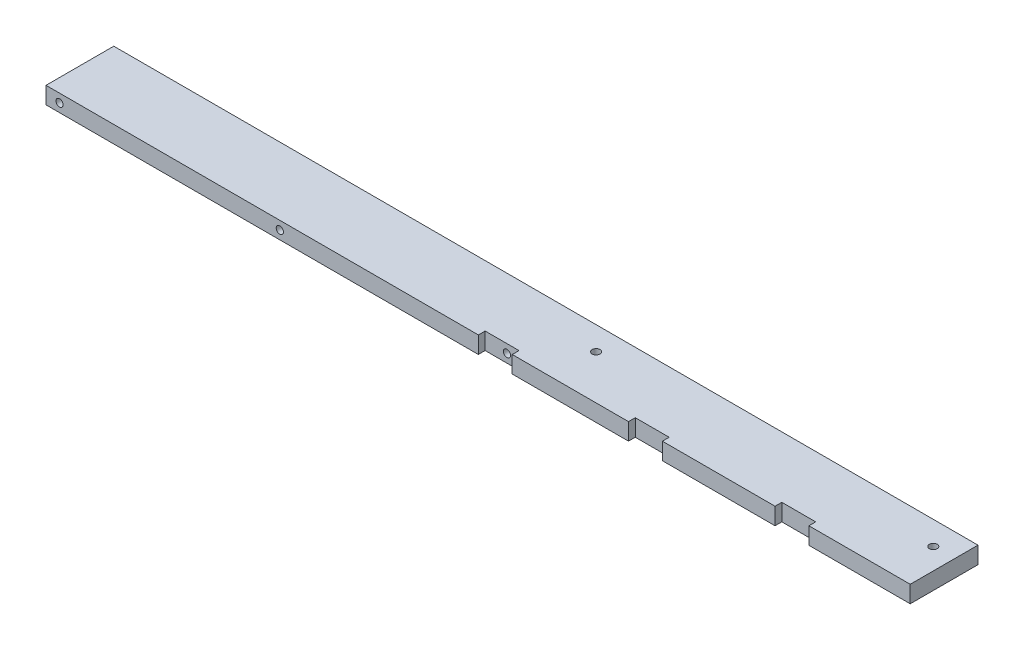
ISO-10303-21;
HEADER;
FILE_DESCRIPTION(('STEP AP214'),'2;1');
FILE_NAME('part.step','',(''),(''),'','','');
FILE_SCHEMA(('AUTOMOTIVE_DESIGN { 1 0 10303 214 1 1 1 1 }'));
ENDSEC;
DATA;
#1=APPLICATION_CONTEXT('core data for automotive mechanical design processes');
#2=APPLICATION_PROTOCOL_DEFINITION('international standard','automotive_design',2000,#1);
#3=PRODUCT_CONTEXT('',#1,'mechanical');
#4=PRODUCT('Part','Part','',(#3));
#5=PRODUCT_RELATED_PRODUCT_CATEGORY('part','',(#4));
#6=PRODUCT_DEFINITION_FORMATION('','',#4);
#7=PRODUCT_DEFINITION_CONTEXT('part definition',#1,'design');
#8=PRODUCT_DEFINITION('design','',#6,#7);
#9=PRODUCT_DEFINITION_SHAPE('','',#8);
#10=(LENGTH_UNIT() NAMED_UNIT(*) SI_UNIT(.MILLI.,.METRE.));
#11=(NAMED_UNIT(*) PLANE_ANGLE_UNIT() SI_UNIT($,.RADIAN.));
#12=(NAMED_UNIT(*) SI_UNIT($,.STERADIAN.) SOLID_ANGLE_UNIT());
#13=UNCERTAINTY_MEASURE_WITH_UNIT(LENGTH_MEASURE(1.E-05),#10,'distance_accuracy_value','');
#14=(GEOMETRIC_REPRESENTATION_CONTEXT(3) GLOBAL_UNCERTAINTY_ASSIGNED_CONTEXT((#13)) GLOBAL_UNIT_ASSIGNED_CONTEXT((#10,
#11,#12)) REPRESENTATION_CONTEXT('',''));
#15=CARTESIAN_POINT('',(0.,0.,0.));
#16=DIRECTION('',(0.,0.,1.));
#17=DIRECTION('',(1.,0.,0.));
#18=AXIS2_PLACEMENT_3D('',#15,#16,#17);
#19=CARTESIAN_POINT('',(323.85,0.,0.));
#20=DIRECTION('',(0.,0.,-1.));
#21=DIRECTION('',(-1.,0.,0.));
#22=AXIS2_PLACEMENT_3D('',#19,#20,#21);
#23=PLANE('',#22);
#24=DIRECTION('',(-1.,0.,0.));
#25=VECTOR('',#24,1.);
#26=CARTESIAN_POINT('',(323.85,6.35,0.));
#27=LINE('',#26,#25);
#28=CARTESIAN_POINT('',(323.85,6.35,0.));
#29=VERTEX_POINT('',#28);
#30=CARTESIAN_POINT('',(285.893126153132,6.35,0.));
#31=VERTEX_POINT('',#30);
#32=EDGE_CURVE('E172',#29,#31,#27,.T.);
#33=ORIENTED_EDGE('',*,*,#32,.T.);
#34=DIRECTION('',(0.,1.,0.));
#35=VECTOR('',#34,1.);
#36=CARTESIAN_POINT('',(285.893126153132,-6.60526299032699,0.));
#37=LINE('',#36,#35);
#38=CARTESIAN_POINT('',(285.893126153132,0.,0.));
#39=VERTEX_POINT('',#38);
#40=EDGE_CURVE('E166',#39,#31,#37,.T.);
#41=ORIENTED_EDGE('',*,*,#40,.F.);
#42=DIRECTION('',(-1.,0.,0.));
#43=VECTOR('',#42,1.);
#44=CARTESIAN_POINT('',(323.85,0.,0.));
#45=LINE('',#44,#43);
#46=CARTESIAN_POINT('',(323.85,0.,0.));
#47=VERTEX_POINT('',#46);
#48=EDGE_CURVE('E188',#47,#39,#45,.T.);
#49=ORIENTED_EDGE('',*,*,#48,.F.);
#50=DIRECTION('',(0.,-1.,0.));
#51=VECTOR('',#50,1.);
#52=CARTESIAN_POINT('',(323.85,0.,0.));
#53=LINE('',#52,#51);
#54=EDGE_CURVE('E218',#29,#47,#53,.T.);
#55=ORIENTED_EDGE('',*,*,#54,.F.);
#56=EDGE_LOOP('',(#33,#41,#49,#55));
#57=FACE_BOUND('',#56,.T.);
#58=ADVANCED_FACE('F36',(#57),#23,.F.);
#59=CARTESIAN_POINT('',(273.193126153132,0.,0.));
#60=VERTEX_POINT('',#59);
#61=CARTESIAN_POINT('',(230.978022183984,0.,0.));
#62=VERTEX_POINT('',#61);
#63=EDGE_CURVE('E165',#60,#62,#45,.T.);
#64=ORIENTED_EDGE('',*,*,#63,.F.);
#65=DIRECTION('',(0.,-1.,0.));
#66=VECTOR('',#65,1.);
#67=CARTESIAN_POINT('',(273.193126153132,-6.60526299032699,0.));
#68=LINE('',#67,#66);
#69=CARTESIAN_POINT('',(273.193126153132,6.35,0.));
#70=VERTEX_POINT('',#69);
#71=EDGE_CURVE('E151',#70,#60,#68,.T.);
#72=ORIENTED_EDGE('',*,*,#71,.F.);
#73=CARTESIAN_POINT('',(230.978022183984,6.35,0.));
#74=VERTEX_POINT('',#73);
#75=EDGE_CURVE('E163',#70,#74,#27,.T.);
#76=ORIENTED_EDGE('',*,*,#75,.T.);
#77=DIRECTION('',(0.,1.,0.));
#78=VECTOR('',#77,1.);
#79=CARTESIAN_POINT('',(230.978022183984,-6.60526299032699,0.));
#80=LINE('',#79,#78);
#81=EDGE_CURVE('E616',#62,#74,#80,.T.);
#82=ORIENTED_EDGE('',*,*,#81,.F.);
#83=EDGE_LOOP('',(#64,#72,#76,#82));
#84=FACE_BOUND('',#83,.T.);
#85=ADVANCED_FACE('F161',(#84),#23,.F.);
#86=CARTESIAN_POINT('',(218.278022183984,0.,0.));
#87=VERTEX_POINT('',#86);
#88=CARTESIAN_POINT('',(174.716366947786,0.,0.));
#89=VERTEX_POINT('',#88);
#90=EDGE_CURVE('E342',#87,#89,#45,.T.);
#91=ORIENTED_EDGE('',*,*,#90,.F.);
#92=DIRECTION('',(0.,-1.,0.));
#93=VECTOR('',#92,1.);
#94=CARTESIAN_POINT('',(218.278022183984,-6.60526299032699,0.));
#95=LINE('',#94,#93);
#96=CARTESIAN_POINT('',(218.278022183984,6.35,0.));
#97=VERTEX_POINT('',#96);
#98=EDGE_CURVE('E612',#97,#87,#95,.T.);
#99=ORIENTED_EDGE('',*,*,#98,.F.);
#100=CARTESIAN_POINT('',(174.716366947786,6.35,0.));
#101=VERTEX_POINT('',#100);
#102=EDGE_CURVE('E173',#97,#101,#27,.T.);
#103=ORIENTED_EDGE('',*,*,#102,.T.);
#104=DIRECTION('',(0.,1.,0.));
#105=VECTOR('',#104,1.);
#106=CARTESIAN_POINT('',(174.716366947786,-7.04680016732617,0.));
#107=LINE('',#106,#105);
#108=EDGE_CURVE('E263',#89,#101,#107,.T.);
#109=ORIENTED_EDGE('',*,*,#108,.F.);
#110=EDGE_LOOP('',(#91,#99,#103,#109));
#111=FACE_BOUND('',#110,.T.);
#112=ADVANCED_FACE('F323',(#111),#23,.F.);
#113=CARTESIAN_POINT('',(170.18,3.175,0.));
#114=DIRECTION('',(0.,0.,1.));
#115=DIRECTION('',(1.,0.,0.));
#116=AXIS2_PLACEMENT_3D('',#113,#114,#115);
#117=CYLINDRICAL_SURFACE('',#116,1.35254999999999);
#118=CARTESIAN_POINT('',(170.18,3.175,-25.4));
#119=DIRECTION('',(0.,0.,1.));
#120=DIRECTION('',(1.,0.,0.));
#121=AXIS2_PLACEMENT_3D('',#118,#119,#120);
#122=CIRCLE('',#121,1.35254999999998);
#123=CARTESIAN_POINT('',(171.53255,3.175,-25.4));
#124=VERTEX_POINT('',#123);
#125=EDGE_CURVE('E227',#124,#124,#122,.T.);
#126=ORIENTED_EDGE('',*,*,#125,.F.);
#127=EDGE_LOOP('',(#126));
#128=FACE_BOUND('',#127,.T.);
#129=CARTESIAN_POINT('',(170.18,3.175,-2.54));
#130=DIRECTION('',(0.,0.,1.));
#131=DIRECTION('',(1.,0.,0.));
#132=AXIS2_PLACEMENT_3D('',#129,#130,#131);
#133=CIRCLE('',#132,1.35254999999999);
#134=CARTESIAN_POINT('',(171.53255,3.175,-2.54));
#135=VERTEX_POINT('',#134);
#136=EDGE_CURVE('E192',#135,#135,#133,.F.);
#137=ORIENTED_EDGE('',*,*,#136,.F.);
#138=EDGE_LOOP('',(#137));
#139=FACE_BOUND('',#138,.T.);
#140=ADVANCED_FACE('F320',(#128,#139),#117,.F.);
#141=CARTESIAN_POINT('',(5.08,3.175,0.));
#142=DIRECTION('',(0.,0.,1.));
#143=DIRECTION('',(1.,0.,0.));
#144=AXIS2_PLACEMENT_3D('',#141,#142,#143);
#145=CIRCLE('',#144,1.35255);
#146=CARTESIAN_POINT('',(6.43255,3.175,0.));
#147=VERTEX_POINT('',#146);
#148=EDGE_CURVE('E304',#147,#147,#145,.T.);
#149=ORIENTED_EDGE('',*,*,#148,.F.);
#150=EDGE_LOOP('',(#149));
#151=FACE_BOUND('',#150,.T.);
#152=CARTESIAN_POINT('',(87.63,3.175,0.));
#153=DIRECTION('',(0.,0.,1.));
#154=DIRECTION('',(1.,0.,0.));
#155=AXIS2_PLACEMENT_3D('',#152,#153,#154);
#156=CIRCLE('',#155,1.35254999999999);
#157=CARTESIAN_POINT('',(88.98255,3.175,0.));
#158=VERTEX_POINT('',#157);
#159=EDGE_CURVE('E310',#158,#158,#156,.T.);
#160=ORIENTED_EDGE('',*,*,#159,.F.);
#161=EDGE_LOOP('',(#160));
#162=FACE_BOUND('',#161,.T.);
#163=CARTESIAN_POINT('',(162.016366947786,0.,0.));
#164=VERTEX_POINT('',#163);
#165=CARTESIAN_POINT('',(0.,0.,0.));
#166=VERTEX_POINT('',#165);
#167=EDGE_CURVE('E187',#164,#166,#45,.T.);
#168=ORIENTED_EDGE('',*,*,#167,.F.);
#169=DIRECTION('',(0.,-1.,0.));
#170=VECTOR('',#169,1.);
#171=CARTESIAN_POINT('',(162.016366947786,-7.04680016732617,0.));
#172=LINE('',#171,#170);
#173=CARTESIAN_POINT('',(162.016366947786,6.35,0.));
#174=VERTEX_POINT('',#173);
#175=EDGE_CURVE('E252',#174,#164,#172,.T.);
#176=ORIENTED_EDGE('',*,*,#175,.F.);
#177=CARTESIAN_POINT('',(0.,6.35,0.));
#178=VERTEX_POINT('',#177);
#179=EDGE_CURVE('E177',#174,#178,#27,.T.);
#180=ORIENTED_EDGE('',*,*,#179,.T.);
#181=DIRECTION('',(0.,-1.,0.));
#182=VECTOR('',#181,1.);
#183=CARTESIAN_POINT('',(0.,0.,0.));
#184=LINE('',#183,#182);
#185=EDGE_CURVE('E233',#178,#166,#184,.T.);
#186=ORIENTED_EDGE('',*,*,#185,.T.);
#187=EDGE_LOOP('',(#168,#176,#180,#186));
#188=FACE_BOUND('',#187,.T.);
#189=ADVANCED_FACE('F38',(#151,#162,#188),#23,.F.);
#190=CARTESIAN_POINT('',(323.85,0.,0.));
#191=DIRECTION('',(0.,1.,0.));
#192=DIRECTION('',(0.,0.,1.));
#193=AXIS2_PLACEMENT_3D('',#190,#191,#192);
#194=PLANE('',#193);
#195=ORIENTED_EDGE('',*,*,#48,.T.);
#196=DIRECTION('',(0.,0.,-1.));
#197=VECTOR('',#196,1.);
#198=CARTESIAN_POINT('',(285.893126153132,0.,0.));
#199=LINE('',#198,#197);
#200=CARTESIAN_POINT('',(285.893126153132,0.,-2.54));
#201=VERTEX_POINT('',#200);
#202=EDGE_CURVE('E602',#39,#201,#199,.T.);
#203=ORIENTED_EDGE('',*,*,#202,.T.);
#204=DIRECTION('',(1.,0.,0.));
#205=VECTOR('',#204,1.);
#206=CARTESIAN_POINT('',(323.85,0.,-2.54));
#207=LINE('',#206,#205);
#208=CARTESIAN_POINT('',(273.193126153132,0.,-2.54));
#209=VERTEX_POINT('',#208);
#210=EDGE_CURVE('E607',#209,#201,#207,.T.);
#211=ORIENTED_EDGE('',*,*,#210,.F.);
#212=DIRECTION('',(0.,0.,1.));
#213=VECTOR('',#212,1.);
#214=CARTESIAN_POINT('',(273.193126153132,0.,0.));
#215=LINE('',#214,#213);
#216=EDGE_CURVE('E609',#209,#60,#215,.T.);
#217=ORIENTED_EDGE('',*,*,#216,.T.);
#218=ORIENTED_EDGE('',*,*,#63,.T.);
#219=DIRECTION('',(0.,0.,-1.));
#220=VECTOR('',#219,1.);
#221=CARTESIAN_POINT('',(230.978022183984,0.,0.));
#222=LINE('',#221,#220);
#223=CARTESIAN_POINT('',(230.978022183984,0.,-2.54));
#224=VERTEX_POINT('',#223);
#225=EDGE_CURVE('E269',#62,#224,#222,.T.);
#226=ORIENTED_EDGE('',*,*,#225,.T.);
#227=DIRECTION('',(1.,0.,0.));
#228=VECTOR('',#227,1.);
#229=CARTESIAN_POINT('',(323.85,0.,-2.54));
#230=LINE('',#229,#228);
#231=CARTESIAN_POINT('',(218.278022183984,0.,-2.54));
#232=VERTEX_POINT('',#231);
#233=EDGE_CURVE('E618',#232,#224,#230,.T.);
#234=ORIENTED_EDGE('',*,*,#233,.F.);
#235=DIRECTION('',(0.,0.,1.));
#236=VECTOR('',#235,1.);
#237=CARTESIAN_POINT('',(218.278022183984,0.,0.));
#238=LINE('',#237,#236);
#239=EDGE_CURVE('E344',#232,#87,#238,.T.);
#240=ORIENTED_EDGE('',*,*,#239,.T.);
#241=ORIENTED_EDGE('',*,*,#90,.T.);
#242=DIRECTION('',(0.,0.,-1.));
#243=VECTOR('',#242,1.);
#244=CARTESIAN_POINT('',(174.716366947786,0.,0.));
#245=LINE('',#244,#243);
#246=CARTESIAN_POINT('',(174.716366947786,0.,-2.54));
#247=VERTEX_POINT('',#246);
#248=EDGE_CURVE('E277',#89,#247,#245,.T.);
#249=ORIENTED_EDGE('',*,*,#248,.T.);
#250=DIRECTION('',(1.,0.,0.));
#251=VECTOR('',#250,1.);
#252=CARTESIAN_POINT('',(323.85,0.,-2.54));
#253=LINE('',#252,#251);
#254=CARTESIAN_POINT('',(162.016366947786,0.,-2.54));
#255=VERTEX_POINT('',#254);
#256=EDGE_CURVE('E274',#255,#247,#253,.T.);
#257=ORIENTED_EDGE('',*,*,#256,.F.);
#258=DIRECTION('',(0.,0.,1.));
#259=VECTOR('',#258,1.);
#260=CARTESIAN_POINT('',(162.016366947786,0.,0.));
#261=LINE('',#260,#259);
#262=EDGE_CURVE('E260',#255,#164,#261,.T.);
#263=ORIENTED_EDGE('',*,*,#262,.T.);
#264=ORIENTED_EDGE('',*,*,#167,.T.);
#265=DIRECTION('',(0.,0.,-1.));
#266=VECTOR('',#265,1.);
#267=CARTESIAN_POINT('',(0.,0.,0.));
#268=LINE('',#267,#266);
#269=CARTESIAN_POINT('',(0.,0.,-25.4));
#270=VERTEX_POINT('',#269);
#271=EDGE_CURVE('E236',#166,#270,#268,.T.);
#272=ORIENTED_EDGE('',*,*,#271,.T.);
#273=DIRECTION('',(-1.,0.,0.));
#274=VECTOR('',#273,1.);
#275=CARTESIAN_POINT('',(323.85,0.,-25.4));
#276=LINE('',#275,#274);
#277=CARTESIAN_POINT('',(323.85,0.,-25.4));
#278=VERTEX_POINT('',#277);
#279=EDGE_CURVE('E184',#278,#270,#276,.T.);
#280=ORIENTED_EDGE('',*,*,#279,.F.);
#281=DIRECTION('',(0.,0.,-1.));
#282=VECTOR('',#281,1.);
#283=CARTESIAN_POINT('',(323.85,0.,0.));
#284=LINE('',#283,#282);
#285=EDGE_CURVE('E220',#47,#278,#284,.T.);
#286=ORIENTED_EDGE('',*,*,#285,.F.);
#287=EDGE_LOOP('',(#195,#203,#211,#217,#218,#226,#234,#240,#241,#249,#257,#263,#264,#272,#280,#286));
#288=FACE_BOUND('',#287,.T.);
#289=CARTESIAN_POINT('',(315.9125,0.,-16.5862));
#290=DIRECTION('',(0.,-1.,0.));
#291=DIRECTION('',(0.,0.,-1.));
#292=AXIS2_PLACEMENT_3D('',#289,#290,#291);
#293=CIRCLE('',#292,2.40030000000002);
#294=CARTESIAN_POINT('',(315.9125,0.,-18.9865));
#295=VERTEX_POINT('',#294);
#296=EDGE_CURVE('E280',#295,#295,#293,.T.);
#297=ORIENTED_EDGE('',*,*,#296,.F.);
#298=EDGE_LOOP('',(#297));
#299=FACE_BOUND('',#298,.T.);
#300=CARTESIAN_POINT('',(189.5475,0.,-16.5862));
#301=DIRECTION('',(0.,-1.,0.));
#302=DIRECTION('',(0.,0.,-1.));
#303=AXIS2_PLACEMENT_3D('',#300,#301,#302);
#304=CIRCLE('',#303,2.40029999999999);
#305=CARTESIAN_POINT('',(189.5475,0.,-18.9865));
#306=VERTEX_POINT('',#305);
#307=EDGE_CURVE('E292',#306,#306,#304,.T.);
#308=ORIENTED_EDGE('',*,*,#307,.F.);
#309=EDGE_LOOP('',(#308));
#310=FACE_BOUND('',#309,.T.);
#311=ADVANCED_FACE('F338',(#288,#299,#310),#194,.F.);
#312=CARTESIAN_POINT('',(323.85,0.,-25.4));
#313=DIRECTION('',(0.,0.,1.));
#314=DIRECTION('',(1.,0.,0.));
#315=AXIS2_PLACEMENT_3D('',#312,#313,#314);
#316=PLANE('',#315);
#317=CARTESIAN_POINT('',(5.08,3.175,-25.4));
#318=DIRECTION('',(0.,0.,1.));
#319=DIRECTION('',(1.,0.,0.));
#320=AXIS2_PLACEMENT_3D('',#317,#318,#319);
#321=CIRCLE('',#320,1.35254999999999);
#322=CARTESIAN_POINT('',(6.43254999999999,3.175,-25.4));
#323=VERTEX_POINT('',#322);
#324=EDGE_CURVE('E307',#323,#323,#321,.T.);
#325=ORIENTED_EDGE('',*,*,#324,.T.);
#326=EDGE_LOOP('',(#325));
#327=FACE_BOUND('',#326,.T.);
#328=CARTESIAN_POINT('',(87.63,3.175,-25.4));
#329=DIRECTION('',(0.,0.,1.));
#330=DIRECTION('',(1.,0.,0.));
#331=AXIS2_PLACEMENT_3D('',#328,#329,#330);
#332=CIRCLE('',#331,1.35254999999999);
#333=CARTESIAN_POINT('',(88.98255,3.175,-25.4));
#334=VERTEX_POINT('',#333);
#335=EDGE_CURVE('E312',#334,#334,#332,.T.);
#336=ORIENTED_EDGE('',*,*,#335,.T.);
#337=EDGE_LOOP('',(#336));
#338=FACE_BOUND('',#337,.T.);
#339=ORIENTED_EDGE('',*,*,#125,.T.);
#340=EDGE_LOOP('',(#339));
#341=FACE_BOUND('',#340,.T.);
#342=DIRECTION('',(0.,1.,0.));
#343=VECTOR('',#342,1.);
#344=CARTESIAN_POINT('',(0.,0.,-25.4));
#345=LINE('',#344,#343);
#346=CARTESIAN_POINT('',(0.,6.35,-25.4));
#347=VERTEX_POINT('',#346);
#348=EDGE_CURVE('E225',#270,#347,#345,.T.);
#349=ORIENTED_EDGE('',*,*,#348,.T.);
#350=DIRECTION('',(-1.,0.,0.));
#351=VECTOR('',#350,1.);
#352=CARTESIAN_POINT('',(323.85,6.35,-25.4));
#353=LINE('',#352,#351);
#354=CARTESIAN_POINT('',(323.85,6.35,-25.4));
#355=VERTEX_POINT('',#354);
#356=EDGE_CURVE('E176',#355,#347,#353,.T.);
#357=ORIENTED_EDGE('',*,*,#356,.F.);
#358=DIRECTION('',(0.,1.,0.));
#359=VECTOR('',#358,1.);
#360=CARTESIAN_POINT('',(323.85,0.,-25.4));
#361=LINE('',#360,#359);
#362=EDGE_CURVE('E222',#278,#355,#361,.T.);
#363=ORIENTED_EDGE('',*,*,#362,.F.);
#364=ORIENTED_EDGE('',*,*,#279,.T.);
#365=EDGE_LOOP('',(#349,#357,#363,#364));
#366=FACE_BOUND('',#365,.T.);
#367=ADVANCED_FACE('F240',(#327,#338,#341,#366),#316,.F.);
#368=CARTESIAN_POINT('',(323.85,6.35,0.));
#369=DIRECTION('',(0.,-1.,0.));
#370=DIRECTION('',(0.,0.,-1.));
#371=AXIS2_PLACEMENT_3D('',#368,#369,#370);
#372=PLANE('',#371);
#373=CARTESIAN_POINT('',(315.9125,6.35,-16.5862));
#374=DIRECTION('',(0.,-1.,0.));
#375=DIRECTION('',(0.,0.,-1.));
#376=AXIS2_PLACEMENT_3D('',#373,#374,#375);
#377=CIRCLE('',#376,1.47320000000001);
#378=CARTESIAN_POINT('',(315.9125,6.35,-18.0594));
#379=VERTEX_POINT('',#378);
#380=EDGE_CURVE('E289',#379,#379,#377,.T.);
#381=ORIENTED_EDGE('',*,*,#380,.T.);
#382=EDGE_LOOP('',(#381));
#383=FACE_BOUND('',#382,.T.);
#384=CARTESIAN_POINT('',(189.5475,6.35,-16.5862));
#385=DIRECTION('',(0.,-1.,0.));
#386=DIRECTION('',(0.,0.,-1.));
#387=AXIS2_PLACEMENT_3D('',#384,#385,#386);
#388=CIRCLE('',#387,1.47320000000001);
#389=CARTESIAN_POINT('',(189.5475,6.35,-18.0594));
#390=VERTEX_POINT('',#389);
#391=EDGE_CURVE('E301',#390,#390,#388,.T.);
#392=ORIENTED_EDGE('',*,*,#391,.T.);
#393=EDGE_LOOP('',(#392));
#394=FACE_BOUND('',#393,.T.);
#395=DIRECTION('',(-1.,0.,0.));
#396=VECTOR('',#395,1.);
#397=CARTESIAN_POINT('',(323.85,6.35,-2.54));
#398=LINE('',#397,#396);
#399=CARTESIAN_POINT('',(285.893126153132,6.35,-2.54));
#400=VERTEX_POINT('',#399);
#401=CARTESIAN_POINT('',(273.193126153132,6.35,-2.54));
#402=VERTEX_POINT('',#401);
#403=EDGE_CURVE('E158',#400,#402,#398,.T.);
#404=ORIENTED_EDGE('',*,*,#403,.F.);
#405=DIRECTION('',(0.,0.,1.));
#406=VECTOR('',#405,1.);
#407=CARTESIAN_POINT('',(285.893126153132,6.35,0.));
#408=LINE('',#407,#406);
#409=EDGE_CURVE('E11',#400,#31,#408,.T.);
#410=ORIENTED_EDGE('',*,*,#409,.T.);
#411=ORIENTED_EDGE('',*,*,#32,.F.);
#412=DIRECTION('',(0.,0.,1.));
#413=VECTOR('',#412,1.);
#414=CARTESIAN_POINT('',(323.85,6.35,0.));
#415=LINE('',#414,#413);
#416=EDGE_CURVE('E231',#355,#29,#415,.T.);
#417=ORIENTED_EDGE('',*,*,#416,.F.);
#418=ORIENTED_EDGE('',*,*,#356,.T.);
#419=DIRECTION('',(0.,0.,1.));
#420=VECTOR('',#419,1.);
#421=CARTESIAN_POINT('',(0.,6.35,0.));
#422=LINE('',#421,#420);
#423=EDGE_CURVE('E180',#347,#178,#422,.T.);
#424=ORIENTED_EDGE('',*,*,#423,.T.);
#425=ORIENTED_EDGE('',*,*,#179,.F.);
#426=DIRECTION('',(0.,0.,-1.));
#427=VECTOR('',#426,1.);
#428=CARTESIAN_POINT('',(162.016366947786,6.35,0.));
#429=LINE('',#428,#427);
#430=CARTESIAN_POINT('',(162.016366947786,6.35,-2.54));
#431=VERTEX_POINT('',#430);
#432=EDGE_CURVE('E191',#174,#431,#429,.T.);
#433=ORIENTED_EDGE('',*,*,#432,.T.);
#434=DIRECTION('',(-1.,0.,0.));
#435=VECTOR('',#434,1.);
#436=CARTESIAN_POINT('',(323.85,6.35,-2.54));
#437=LINE('',#436,#435);
#438=CARTESIAN_POINT('',(174.716366947786,6.35,-2.54));
#439=VERTEX_POINT('',#438);
#440=EDGE_CURVE('E195',#439,#431,#437,.T.);
#441=ORIENTED_EDGE('',*,*,#440,.F.);
#442=DIRECTION('',(0.,0.,1.));
#443=VECTOR('',#442,1.);
#444=CARTESIAN_POINT('',(174.716366947786,6.35,0.));
#445=LINE('',#444,#443);
#446=EDGE_CURVE('E199',#439,#101,#445,.T.);
#447=ORIENTED_EDGE('',*,*,#446,.T.);
#448=ORIENTED_EDGE('',*,*,#102,.F.);
#449=DIRECTION('',(0.,0.,-1.));
#450=VECTOR('',#449,1.);
#451=CARTESIAN_POINT('',(218.278022183984,6.35,0.));
#452=LINE('',#451,#450);
#453=CARTESIAN_POINT('',(218.278022183984,6.35,-2.54));
#454=VERTEX_POINT('',#453);
#455=EDGE_CURVE('E204',#97,#454,#452,.T.);
#456=ORIENTED_EDGE('',*,*,#455,.T.);
#457=DIRECTION('',(-1.,0.,0.));
#458=VECTOR('',#457,1.);
#459=CARTESIAN_POINT('',(323.85,6.35,-2.54));
#460=LINE('',#459,#458);
#461=CARTESIAN_POINT('',(230.978022183984,6.35,-2.54));
#462=VERTEX_POINT('',#461);
#463=EDGE_CURVE('E202',#462,#454,#460,.T.);
#464=ORIENTED_EDGE('',*,*,#463,.F.);
#465=DIRECTION('',(0.,0.,1.));
#466=VECTOR('',#465,1.);
#467=CARTESIAN_POINT('',(230.978022183984,6.35,0.));
#468=LINE('',#467,#466);
#469=EDGE_CURVE('E171',#462,#74,#468,.T.);
#470=ORIENTED_EDGE('',*,*,#469,.T.);
#471=ORIENTED_EDGE('',*,*,#75,.F.);
#472=DIRECTION('',(0.,0.,-1.));
#473=VECTOR('',#472,1.);
#474=CARTESIAN_POINT('',(273.193126153132,6.35,0.));
#475=LINE('',#474,#473);
#476=EDGE_CURVE('E44',#70,#402,#475,.T.);
#477=ORIENTED_EDGE('',*,*,#476,.T.);
#478=EDGE_LOOP('',(#404,#410,#411,#417,#418,#424,#425,#433,#441,#447,#448,#456,#464,#470,#471,#477));
#479=FACE_BOUND('',#478,.T.);
#480=ADVANCED_FACE('F169',(#383,#394,#479),#372,.F.);
#481=CARTESIAN_POINT('',(323.85,0.,0.));
#482=DIRECTION('',(-1.,0.,0.));
#483=DIRECTION('',(0.,0.,1.));
#484=AXIS2_PLACEMENT_3D('',#481,#482,#483);
#485=PLANE('',#484);
#486=ORIENTED_EDGE('',*,*,#54,.T.);
#487=ORIENTED_EDGE('',*,*,#285,.T.);
#488=ORIENTED_EDGE('',*,*,#362,.T.);
#489=ORIENTED_EDGE('',*,*,#416,.T.);
#490=EDGE_LOOP('',(#486,#487,#488,#489));
#491=FACE_BOUND('',#490,.T.);
#492=ADVANCED_FACE('F347',(#491),#485,.F.);
#493=CARTESIAN_POINT('',(0.,0.,0.));
#494=DIRECTION('',(-1.,0.,0.));
#495=DIRECTION('',(0.,0.,1.));
#496=AXIS2_PLACEMENT_3D('',#493,#494,#495);
#497=PLANE('',#496);
#498=ORIENTED_EDGE('',*,*,#185,.F.);
#499=ORIENTED_EDGE('',*,*,#423,.F.);
#500=ORIENTED_EDGE('',*,*,#348,.F.);
#501=ORIENTED_EDGE('',*,*,#271,.F.);
#502=EDGE_LOOP('',(#498,#499,#500,#501));
#503=FACE_BOUND('',#502,.T.);
#504=ADVANCED_FACE('F248',(#503),#497,.T.);
#505=CARTESIAN_POINT('',(87.63,3.175,0.));
#506=DIRECTION('',(0.,0.,1.));
#507=DIRECTION('',(1.,0.,0.));
#508=AXIS2_PLACEMENT_3D('',#505,#506,#507);
#509=CYLINDRICAL_SURFACE('',#508,1.35254999999999);
#510=ORIENTED_EDGE('',*,*,#335,.F.);
#511=EDGE_LOOP('',(#510));
#512=FACE_BOUND('',#511,.T.);
#513=ORIENTED_EDGE('',*,*,#159,.T.);
#514=EDGE_LOOP('',(#513));
#515=FACE_BOUND('',#514,.T.);
#516=ADVANCED_FACE('F354',(#512,#515),#509,.F.);
#517=CARTESIAN_POINT('',(5.08,3.175,0.));
#518=DIRECTION('',(0.,0.,1.));
#519=DIRECTION('',(1.,0.,0.));
#520=AXIS2_PLACEMENT_3D('',#517,#518,#519);
#521=CYLINDRICAL_SURFACE('',#520,1.35254999999999);
#522=ORIENTED_EDGE('',*,*,#324,.F.);
#523=EDGE_LOOP('',(#522));
#524=FACE_BOUND('',#523,.T.);
#525=ORIENTED_EDGE('',*,*,#148,.T.);
#526=EDGE_LOOP('',(#525));
#527=FACE_BOUND('',#526,.T.);
#528=ADVANCED_FACE('F502',(#524,#527),#521,.F.);
#529=CARTESIAN_POINT('',(189.5475,0.,-16.5862));
#530=DIRECTION('',(0.,-1.,0.));
#531=DIRECTION('',(0.,0.,-1.));
#532=AXIS2_PLACEMENT_3D('',#529,#530,#531);
#533=CYLINDRICAL_SURFACE('',#532,1.47320000000001);
#534=ORIENTED_EDGE('',*,*,#391,.F.);
#535=EDGE_LOOP('',(#534));
#536=FACE_BOUND('',#535,.T.);
#537=CARTESIAN_POINT('',(189.5475,2.8448,-16.5862));
#538=DIRECTION('',(0.,-1.,0.));
#539=DIRECTION('',(0.,0.,-1.));
#540=AXIS2_PLACEMENT_3D('',#537,#538,#539);
#541=CIRCLE('',#540,1.47320000000001);
#542=CARTESIAN_POINT('',(189.5475,2.8448,-18.0594));
#543=VERTEX_POINT('',#542);
#544=EDGE_CURVE('E298',#543,#543,#541,.T.);
#545=ORIENTED_EDGE('',*,*,#544,.T.);
#546=EDGE_LOOP('',(#545));
#547=FACE_BOUND('',#546,.T.);
#548=ADVANCED_FACE('F498',(#536,#547),#533,.F.);
#549=CARTESIAN_POINT('',(191.0207,2.8448,-16.5862));
#550=DIRECTION('',(0.,1.,0.));
#551=DIRECTION('',(0.,0.,1.));
#552=AXIS2_PLACEMENT_3D('',#549,#550,#551);
#553=PLANE('',#552);
#554=ORIENTED_EDGE('',*,*,#544,.F.);
#555=EDGE_LOOP('',(#554));
#556=FACE_BOUND('',#555,.T.);
#557=CARTESIAN_POINT('',(189.5475,2.8448,-16.5862));
#558=DIRECTION('',(0.,-1.,0.));
#559=DIRECTION('',(0.,0.,-1.));
#560=AXIS2_PLACEMENT_3D('',#557,#558,#559);
#561=CIRCLE('',#560,2.40029999999999);
#562=CARTESIAN_POINT('',(189.5475,2.8448,-18.9865));
#563=VERTEX_POINT('',#562);
#564=EDGE_CURVE('E295',#563,#563,#561,.T.);
#565=ORIENTED_EDGE('',*,*,#564,.T.);
#566=EDGE_LOOP('',(#565));
#567=FACE_BOUND('',#566,.T.);
#568=ADVANCED_FACE('F494',(#556,#567),#553,.F.);
#569=CARTESIAN_POINT('',(189.5475,0.,-16.5862));
#570=DIRECTION('',(0.,-1.,0.));
#571=DIRECTION('',(0.,0.,-1.));
#572=AXIS2_PLACEMENT_3D('',#569,#570,#571);
#573=CYLINDRICAL_SURFACE('',#572,2.40029999999999);
#574=ORIENTED_EDGE('',*,*,#564,.F.);
#575=EDGE_LOOP('',(#574));
#576=FACE_BOUND('',#575,.T.);
#577=ORIENTED_EDGE('',*,*,#307,.T.);
#578=EDGE_LOOP('',(#577));
#579=FACE_BOUND('',#578,.T.);
#580=ADVANCED_FACE('F490',(#576,#579),#573,.F.);
#581=CARTESIAN_POINT('',(315.9125,0.,-16.5862));
#582=DIRECTION('',(0.,-1.,0.));
#583=DIRECTION('',(0.,0.,-1.));
#584=AXIS2_PLACEMENT_3D('',#581,#582,#583);
#585=CYLINDRICAL_SURFACE('',#584,1.47320000000001);
#586=ORIENTED_EDGE('',*,*,#380,.F.);
#587=EDGE_LOOP('',(#586));
#588=FACE_BOUND('',#587,.T.);
#589=CARTESIAN_POINT('',(315.9125,2.8448,-16.5862));
#590=DIRECTION('',(0.,-1.,0.));
#591=DIRECTION('',(0.,0.,-1.));
#592=AXIS2_PLACEMENT_3D('',#589,#590,#591);
#593=CIRCLE('',#592,1.47320000000001);
#594=CARTESIAN_POINT('',(315.9125,2.8448,-18.0594));
#595=VERTEX_POINT('',#594);
#596=EDGE_CURVE('E286',#595,#595,#593,.T.);
#597=ORIENTED_EDGE('',*,*,#596,.T.);
#598=EDGE_LOOP('',(#597));
#599=FACE_BOUND('',#598,.T.);
#600=ADVANCED_FACE('F486',(#588,#599),#585,.F.);
#601=CARTESIAN_POINT('',(317.3857,2.8448,-16.5862));
#602=DIRECTION('',(0.,1.,0.));
#603=DIRECTION('',(0.,0.,1.));
#604=AXIS2_PLACEMENT_3D('',#601,#602,#603);
#605=PLANE('',#604);
#606=ORIENTED_EDGE('',*,*,#596,.F.);
#607=EDGE_LOOP('',(#606));
#608=FACE_BOUND('',#607,.T.);
#609=CARTESIAN_POINT('',(315.9125,2.8448,-16.5862));
#610=DIRECTION('',(0.,-1.,0.));
#611=DIRECTION('',(0.,0.,-1.));
#612=AXIS2_PLACEMENT_3D('',#609,#610,#611);
#613=CIRCLE('',#612,2.40030000000002);
#614=CARTESIAN_POINT('',(315.9125,2.8448,-18.9865));
#615=VERTEX_POINT('',#614);
#616=EDGE_CURVE('E283',#615,#615,#613,.T.);
#617=ORIENTED_EDGE('',*,*,#616,.T.);
#618=EDGE_LOOP('',(#617));
#619=FACE_BOUND('',#618,.T.);
#620=ADVANCED_FACE('F482',(#608,#619),#605,.F.);
#621=CARTESIAN_POINT('',(315.9125,0.,-16.5862));
#622=DIRECTION('',(0.,-1.,0.));
#623=DIRECTION('',(0.,0.,-1.));
#624=AXIS2_PLACEMENT_3D('',#621,#622,#623);
#625=CYLINDRICAL_SURFACE('',#624,2.40030000000002);
#626=ORIENTED_EDGE('',*,*,#616,.F.);
#627=EDGE_LOOP('',(#626));
#628=FACE_BOUND('',#627,.T.);
#629=ORIENTED_EDGE('',*,*,#296,.T.);
#630=EDGE_LOOP('',(#629));
#631=FACE_BOUND('',#630,.T.);
#632=ADVANCED_FACE('F407',(#628,#631),#625,.F.);
#633=CARTESIAN_POINT('',(174.716366947786,-7.04680016732617,-2.54));
#634=DIRECTION('',(1.,0.,0.));
#635=DIRECTION('',(0.,0.,-1.));
#636=AXIS2_PLACEMENT_3D('',#633,#634,#635);
#637=PLANE('',#636);
#638=ORIENTED_EDGE('',*,*,#108,.T.);
#639=ORIENTED_EDGE('',*,*,#446,.F.);
#640=DIRECTION('',(0.,1.,0.));
#641=VECTOR('',#640,1.);
#642=CARTESIAN_POINT('',(174.716366947786,-7.04680016732617,-2.54));
#643=LINE('',#642,#641);
#644=EDGE_CURVE('E196',#247,#439,#643,.T.);
#645=ORIENTED_EDGE('',*,*,#644,.F.);
#646=ORIENTED_EDGE('',*,*,#248,.F.);
#647=EDGE_LOOP('',(#638,#639,#645,#646));
#648=FACE_BOUND('',#647,.T.);
#649=ADVANCED_FACE('F336',(#648),#637,.F.);
#650=CARTESIAN_POINT('',(162.016366947786,-7.04680016732617,-2.54));
#651=DIRECTION('',(-1.,0.,0.));
#652=DIRECTION('',(0.,0.,1.));
#653=AXIS2_PLACEMENT_3D('',#650,#651,#652);
#654=PLANE('',#653);
#655=DIRECTION('',(0.,-1.,0.));
#656=VECTOR('',#655,1.);
#657=CARTESIAN_POINT('',(162.016366947786,-7.04680016732617,-2.54));
#658=LINE('',#657,#656);
#659=EDGE_CURVE('E259',#431,#255,#658,.T.);
#660=ORIENTED_EDGE('',*,*,#659,.F.);
#661=ORIENTED_EDGE('',*,*,#432,.F.);
#662=ORIENTED_EDGE('',*,*,#175,.T.);
#663=ORIENTED_EDGE('',*,*,#262,.F.);
#664=EDGE_LOOP('',(#660,#661,#662,#663));
#665=FACE_BOUND('',#664,.T.);
#666=ADVANCED_FACE('F256',(#665),#654,.F.);
#667=CARTESIAN_POINT('',(0.,0.,-2.54));
#668=DIRECTION('',(0.,0.,1.));
#669=DIRECTION('',(1.,0.,0.));
#670=AXIS2_PLACEMENT_3D('',#667,#668,#669);
#671=PLANE('',#670);
#672=ORIENTED_EDGE('',*,*,#136,.T.);
#673=EDGE_LOOP('',(#672));
#674=FACE_BOUND('',#673,.T.);
#675=ORIENTED_EDGE('',*,*,#256,.T.);
#676=ORIENTED_EDGE('',*,*,#644,.T.);
#677=ORIENTED_EDGE('',*,*,#440,.T.);
#678=ORIENTED_EDGE('',*,*,#659,.T.);
#679=EDGE_LOOP('',(#675,#676,#677,#678));
#680=FACE_BOUND('',#679,.T.);
#681=ADVANCED_FACE('F327',(#674,#680),#671,.T.);
#682=CARTESIAN_POINT('',(230.978022183984,-6.60526299032699,-2.54));
#683=DIRECTION('',(1.,0.,0.));
#684=DIRECTION('',(0.,0.,-1.));
#685=AXIS2_PLACEMENT_3D('',#682,#683,#684);
#686=PLANE('',#685);
#687=ORIENTED_EDGE('',*,*,#81,.T.);
#688=ORIENTED_EDGE('',*,*,#469,.F.);
#689=DIRECTION('',(0.,1.,0.));
#690=VECTOR('',#689,1.);
#691=CARTESIAN_POINT('',(230.978022183984,-6.60526299032699,-2.54));
#692=LINE('',#691,#690);
#693=EDGE_CURVE('E59',#224,#462,#692,.T.);
#694=ORIENTED_EDGE('',*,*,#693,.F.);
#695=ORIENTED_EDGE('',*,*,#225,.F.);
#696=EDGE_LOOP('',(#687,#688,#694,#695));
#697=FACE_BOUND('',#696,.T.);
#698=ADVANCED_FACE('F329',(#697),#686,.F.);
#699=CARTESIAN_POINT('',(218.278022183984,-6.60526299032699,-2.54));
#700=DIRECTION('',(-1.,0.,0.));
#701=DIRECTION('',(0.,0.,1.));
#702=AXIS2_PLACEMENT_3D('',#699,#700,#701);
#703=PLANE('',#702);
#704=DIRECTION('',(0.,-1.,0.));
#705=VECTOR('',#704,1.);
#706=CARTESIAN_POINT('',(218.278022183984,-6.60526299032699,-2.54));
#707=LINE('',#706,#705);
#708=EDGE_CURVE('E613',#454,#232,#707,.T.);
#709=ORIENTED_EDGE('',*,*,#708,.F.);
#710=ORIENTED_EDGE('',*,*,#455,.F.);
#711=ORIENTED_EDGE('',*,*,#98,.T.);
#712=ORIENTED_EDGE('',*,*,#239,.F.);
#713=EDGE_LOOP('',(#709,#710,#711,#712));
#714=FACE_BOUND('',#713,.T.);
#715=ADVANCED_FACE('F432',(#714),#703,.F.);
#716=CARTESIAN_POINT('',(0.,0.,-2.54));
#717=DIRECTION('',(0.,0.,1.));
#718=DIRECTION('',(1.,0.,0.));
#719=AXIS2_PLACEMENT_3D('',#716,#717,#718);
#720=PLANE('',#719);
#721=ORIENTED_EDGE('',*,*,#233,.T.);
#722=ORIENTED_EDGE('',*,*,#693,.T.);
#723=ORIENTED_EDGE('',*,*,#463,.T.);
#724=ORIENTED_EDGE('',*,*,#708,.T.);
#725=EDGE_LOOP('',(#721,#722,#723,#724));
#726=FACE_BOUND('',#725,.T.);
#727=ADVANCED_FACE('F442',(#726),#720,.T.);
#728=CARTESIAN_POINT('',(285.893126153132,-6.60526299032699,-2.54));
#729=DIRECTION('',(1.,0.,0.));
#730=DIRECTION('',(0.,0.,-1.));
#731=AXIS2_PLACEMENT_3D('',#728,#729,#730);
#732=PLANE('',#731);
#733=ORIENTED_EDGE('',*,*,#40,.T.);
#734=ORIENTED_EDGE('',*,*,#409,.F.);
#735=DIRECTION('',(0.,1.,0.));
#736=VECTOR('',#735,1.);
#737=CARTESIAN_POINT('',(285.893126153132,-6.60526299032699,-2.54));
#738=LINE('',#737,#736);
#739=EDGE_CURVE('E51',#201,#400,#738,.T.);
#740=ORIENTED_EDGE('',*,*,#739,.F.);
#741=ORIENTED_EDGE('',*,*,#202,.F.);
#742=EDGE_LOOP('',(#733,#734,#740,#741));
#743=FACE_BOUND('',#742,.T.);
#744=ADVANCED_FACE('F452',(#743),#732,.F.);
#745=CARTESIAN_POINT('',(273.193126153132,-6.60526299032699,-2.54));
#746=DIRECTION('',(-1.,0.,0.));
#747=DIRECTION('',(0.,0.,1.));
#748=AXIS2_PLACEMENT_3D('',#745,#746,#747);
#749=PLANE('',#748);
#750=DIRECTION('',(0.,-1.,0.));
#751=VECTOR('',#750,1.);
#752=CARTESIAN_POINT('',(273.193126153132,-6.60526299032699,-2.54));
#753=LINE('',#752,#751);
#754=EDGE_CURVE('E154',#402,#209,#753,.T.);
#755=ORIENTED_EDGE('',*,*,#754,.F.);
#756=ORIENTED_EDGE('',*,*,#476,.F.);
#757=ORIENTED_EDGE('',*,*,#71,.T.);
#758=ORIENTED_EDGE('',*,*,#216,.F.);
#759=EDGE_LOOP('',(#755,#756,#757,#758));
#760=FACE_BOUND('',#759,.T.);
#761=ADVANCED_FACE('F150',(#760),#749,.F.);
#762=CARTESIAN_POINT('',(0.,0.,-2.54));
#763=DIRECTION('',(0.,0.,1.));
#764=DIRECTION('',(1.,0.,0.));
#765=AXIS2_PLACEMENT_3D('',#762,#763,#764);
#766=PLANE('',#765);
#767=ORIENTED_EDGE('',*,*,#210,.T.);
#768=ORIENTED_EDGE('',*,*,#739,.T.);
#769=ORIENTED_EDGE('',*,*,#403,.T.);
#770=ORIENTED_EDGE('',*,*,#754,.T.);
#771=EDGE_LOOP('',(#767,#768,#769,#770));
#772=FACE_BOUND('',#771,.T.);
#773=ADVANCED_FACE('F208',(#772),#766,.T.);
#774=CLOSED_SHELL('',(#58,#85,#112,#140,#189,#311,#367,#480,#492,#504,#516,#528,#548,#568,#580,
#600,#620,#632,#649,#666,#681,#698,#715,#727,#744,#761,#773));
#775=MANIFOLD_SOLID_BREP('B2',#774);
#776=ADVANCED_BREP_SHAPE_REPRESENTATION('',(#18,#775),#14);
#777=SHAPE_DEFINITION_REPRESENTATION(#9,#776);
ENDSEC;
END-ISO-10303-21;
